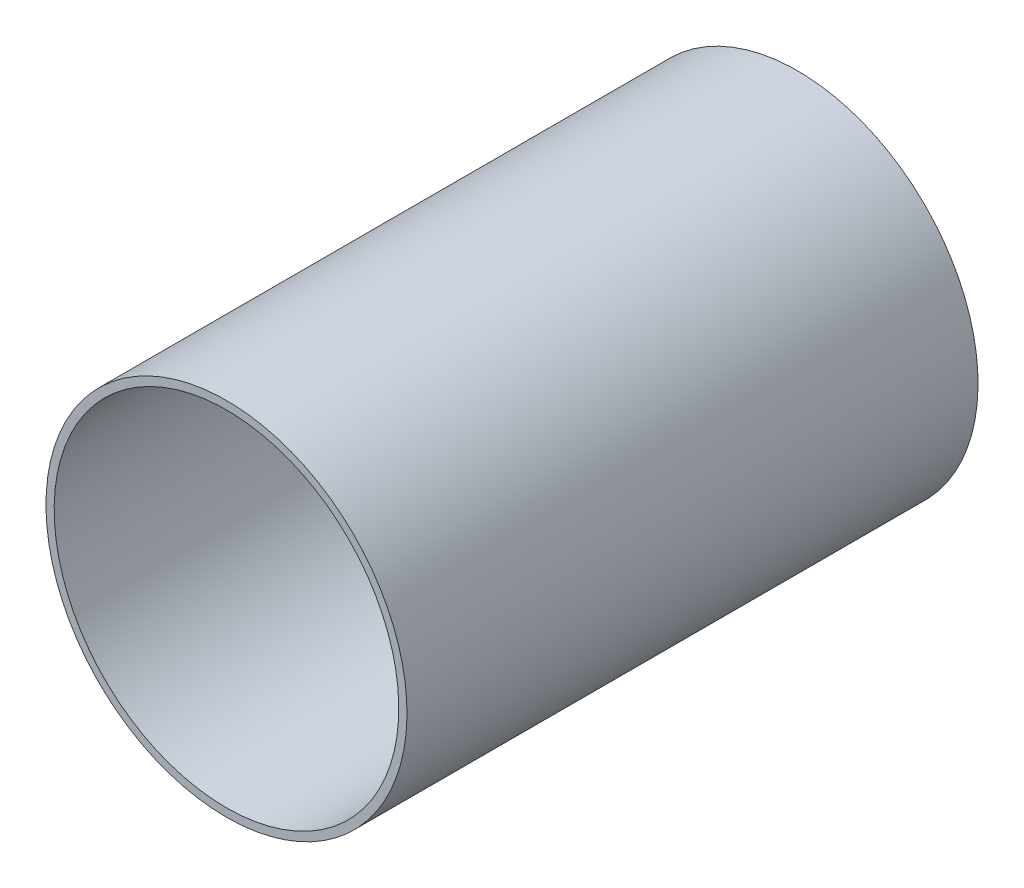
ISO-10303-21;
HEADER;
FILE_DESCRIPTION(('STEP AP214'),'2;1');
FILE_NAME('part.step','',(''),(''),'','','');
FILE_SCHEMA(('AUTOMOTIVE_DESIGN { 1 0 10303 214 1 1 1 1 }'));
ENDSEC;
DATA;
#1=APPLICATION_CONTEXT('core data for automotive mechanical design processes');
#2=APPLICATION_PROTOCOL_DEFINITION('international standard','automotive_design',2000,#1);
#3=PRODUCT_CONTEXT('',#1,'mechanical');
#4=PRODUCT('Part','Part','',(#3));
#5=PRODUCT_RELATED_PRODUCT_CATEGORY('part','',(#4));
#6=PRODUCT_DEFINITION_FORMATION('','',#4);
#7=PRODUCT_DEFINITION_CONTEXT('part definition',#1,'design');
#8=PRODUCT_DEFINITION('design','',#6,#7);
#9=PRODUCT_DEFINITION_SHAPE('','',#8);
#10=(LENGTH_UNIT() NAMED_UNIT(*) SI_UNIT(.MILLI.,.METRE.));
#11=(NAMED_UNIT(*) PLANE_ANGLE_UNIT() SI_UNIT($,.RADIAN.));
#12=(NAMED_UNIT(*) SI_UNIT($,.STERADIAN.) SOLID_ANGLE_UNIT());
#13=UNCERTAINTY_MEASURE_WITH_UNIT(LENGTH_MEASURE(1.E-05),#10,'distance_accuracy_value','');
#14=(GEOMETRIC_REPRESENTATION_CONTEXT(3) GLOBAL_UNCERTAINTY_ASSIGNED_CONTEXT((#13)) GLOBAL_UNIT_ASSIGNED_CONTEXT((#10,
#11,#12)) REPRESENTATION_CONTEXT('',''));
#15=CARTESIAN_POINT('',(0.,0.,0.));
#16=DIRECTION('',(0.,0.,1.));
#17=DIRECTION('',(1.,0.,0.));
#18=AXIS2_PLACEMENT_3D('',#15,#16,#17);
#19=CARTESIAN_POINT('',(129.352,-111.684,-0.045));
#20=DIRECTION('',(0.,0.,-1.));
#21=DIRECTION('',(0.,-1.,0.));
#22=AXIS2_PLACEMENT_3D('',#19,#20,#21);
#23=CYLINDRICAL_SURFACE('',#22,0.525);
#24=CARTESIAN_POINT('',(129.352,-111.684,-0.035));
#25=DIRECTION('',(0.,0.,-1.));
#26=DIRECTION('',(0.,-1.,0.));
#27=AXIS2_PLACEMENT_3D('',#24,#25,#26);
#28=CIRCLE('',#27,0.525);
#29=CARTESIAN_POINT('',(129.352,-112.209,-0.035));
#30=VERTEX_POINT('',#29);
#31=EDGE_CURVE('E64',#30,#30,#28,.T.);
#32=ORIENTED_EDGE('',*,*,#31,.T.);
#33=DIRECTION('',(0.,0.,1.));
#34=VECTOR('',#33,1.);
#35=CARTESIAN_POINT('',(129.352,-112.209,-0.045));
#36=LINE('',#35,#34);
#37=CARTESIAN_POINT('',(129.352,-112.209,1.705));
#38=VERTEX_POINT('',#37);
#39=EDGE_CURVE('E11',#30,#38,#36,.T.);
#40=ORIENTED_EDGE('',*,*,#39,.T.);
#41=CARTESIAN_POINT('',(129.352,-111.684,1.705));
#42=DIRECTION('',(0.,0.,-1.));
#43=DIRECTION('',(0.,-1.,0.));
#44=AXIS2_PLACEMENT_3D('',#41,#42,#43);
#45=CIRCLE('',#44,0.525);
#46=EDGE_CURVE('E25',#38,#38,#45,.T.);
#47=ORIENTED_EDGE('',*,*,#46,.F.);
#48=ORIENTED_EDGE('',*,*,#39,.F.);
#49=EDGE_LOOP('',(#32,#40,#47,#48));
#50=FACE_BOUND('',#49,.T.);
#51=ADVANCED_FACE('F17',(#50),#23,.F.);
#52=CARTESIAN_POINT('',(129.352,-112.234,1.705));
#53=DIRECTION('',(0.,0.,1.));
#54=DIRECTION('',(1.,0.,0.));
#55=AXIS2_PLACEMENT_3D('',#52,#53,#54);
#56=PLANE('',#55);
#57=ORIENTED_EDGE('',*,*,#46,.T.);
#58=EDGE_LOOP('',(#57));
#59=FACE_BOUND('',#58,.T.);
#60=CARTESIAN_POINT('',(129.352,-111.684,1.705));
#61=DIRECTION('',(0.,0.,1.));
#62=DIRECTION('',(0.,-1.,0.));
#63=AXIS2_PLACEMENT_3D('',#60,#61,#62);
#64=CIRCLE('',#63,0.55);
#65=CARTESIAN_POINT('',(129.352,-112.234,1.705));
#66=VERTEX_POINT('',#65);
#67=EDGE_CURVE('E56',#66,#66,#64,.T.);
#68=ORIENTED_EDGE('',*,*,#67,.T.);
#69=EDGE_LOOP('',(#68));
#70=FACE_BOUND('',#69,.T.);
#71=ADVANCED_FACE('F73',(#59,#70),#56,.T.);
#72=CARTESIAN_POINT('',(129.352,-112.234,-0.035));
#73=DIRECTION('',(0.,0.,1.));
#74=DIRECTION('',(1.,0.,0.));
#75=AXIS2_PLACEMENT_3D('',#72,#73,#74);
#76=PLANE('',#75);
#77=ORIENTED_EDGE('',*,*,#31,.F.);
#78=EDGE_LOOP('',(#77));
#79=FACE_BOUND('',#78,.T.);
#80=CARTESIAN_POINT('',(129.352,-111.684,-0.035));
#81=DIRECTION('',(0.,0.,1.));
#82=DIRECTION('',(0.,-1.,0.));
#83=AXIS2_PLACEMENT_3D('',#80,#81,#82);
#84=CIRCLE('',#83,0.55);
#85=CARTESIAN_POINT('',(129.352,-112.234,-0.035));
#86=VERTEX_POINT('',#85);
#87=EDGE_CURVE('E55',#86,#86,#84,.T.);
#88=ORIENTED_EDGE('',*,*,#87,.F.);
#89=EDGE_LOOP('',(#88));
#90=FACE_BOUND('',#89,.T.);
#91=ADVANCED_FACE('F82',(#79,#90),#76,.F.);
#92=CARTESIAN_POINT('',(129.352,-111.684,-0.035));
#93=DIRECTION('',(0.,0.,-1.));
#94=DIRECTION('',(0.,-1.,0.));
#95=AXIS2_PLACEMENT_3D('',#92,#93,#94);
#96=CYLINDRICAL_SURFACE('',#95,0.55);
#97=ORIENTED_EDGE('',*,*,#87,.T.);
#98=DIRECTION('',(0.,0.,1.));
#99=VECTOR('',#98,1.);
#100=CARTESIAN_POINT('',(129.352,-112.234,-0.035));
#101=LINE('',#100,#99);
#102=EDGE_CURVE('E52',#86,#66,#101,.T.);
#103=ORIENTED_EDGE('',*,*,#102,.T.);
#104=ORIENTED_EDGE('',*,*,#67,.F.);
#105=ORIENTED_EDGE('',*,*,#102,.F.);
#106=EDGE_LOOP('',(#97,#103,#104,#105));
#107=FACE_BOUND('',#106,.T.);
#108=ADVANCED_FACE('F53',(#107),#96,.T.);
#109=CLOSED_SHELL('',(#51,#71,#91,#108));
#110=MANIFOLD_SOLID_BREP('B1',#109);
#111=ADVANCED_BREP_SHAPE_REPRESENTATION('',(#18,#110),#14);
#112=SHAPE_DEFINITION_REPRESENTATION(#9,#111);
ENDSEC;
END-ISO-10303-21;
